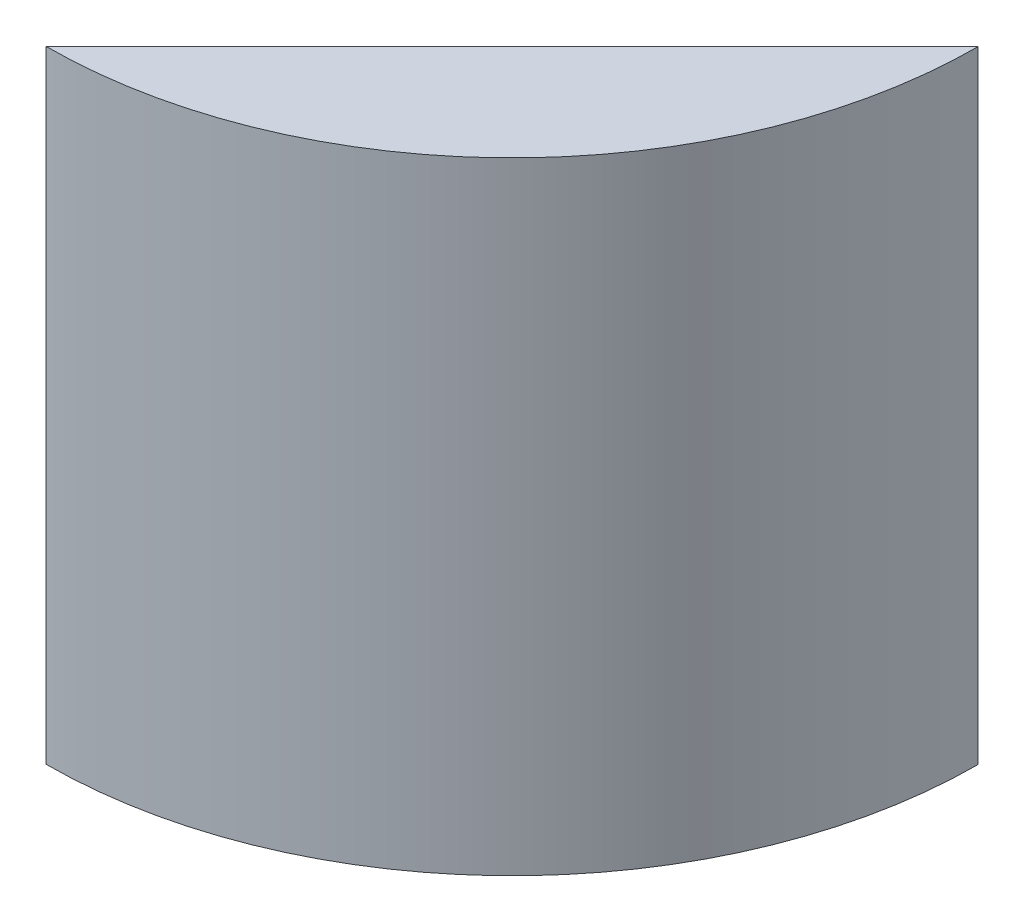
ISO-10303-21;
HEADER;
FILE_DESCRIPTION(('STEP AP214'),'2;1');
FILE_NAME('part.step','',(''),(''),'','','');
FILE_SCHEMA(('AUTOMOTIVE_DESIGN { 1 0 10303 214 1 1 1 1 }'));
ENDSEC;
DATA;
#1=APPLICATION_CONTEXT('core data for automotive mechanical design processes');
#2=APPLICATION_PROTOCOL_DEFINITION('international standard','automotive_design',2000,#1);
#3=PRODUCT_CONTEXT('',#1,'mechanical');
#4=PRODUCT('Part','Part','',(#3));
#5=PRODUCT_RELATED_PRODUCT_CATEGORY('part','',(#4));
#6=PRODUCT_DEFINITION_FORMATION('','',#4);
#7=PRODUCT_DEFINITION_CONTEXT('part definition',#1,'design');
#8=PRODUCT_DEFINITION('design','',#6,#7);
#9=PRODUCT_DEFINITION_SHAPE('','',#8);
#10=(LENGTH_UNIT() NAMED_UNIT(*) SI_UNIT(.MILLI.,.METRE.));
#11=(NAMED_UNIT(*) PLANE_ANGLE_UNIT() SI_UNIT($,.RADIAN.));
#12=(NAMED_UNIT(*) SI_UNIT($,.STERADIAN.) SOLID_ANGLE_UNIT());
#13=UNCERTAINTY_MEASURE_WITH_UNIT(LENGTH_MEASURE(1.E-05),#10,'distance_accuracy_value','');
#14=(GEOMETRIC_REPRESENTATION_CONTEXT(3) GLOBAL_UNCERTAINTY_ASSIGNED_CONTEXT((#13)) GLOBAL_UNIT_ASSIGNED_CONTEXT((#10,
#11,#12)) REPRESENTATION_CONTEXT('',''));
#15=CARTESIAN_POINT('',(0.,0.,0.));
#16=DIRECTION('',(0.,0.,1.));
#17=DIRECTION('',(1.,0.,0.));
#18=AXIS2_PLACEMENT_3D('',#15,#16,#17);
#19=CARTESIAN_POINT('',(0.,114.3,0.));
#20=DIRECTION('',(0.,-1.,0.));
#21=DIRECTION('',(0.,0.,-1.));
#22=AXIS2_PLACEMENT_3D('',#19,#20,#21);
#23=CYLINDRICAL_SURFACE('',#22,85.725);
#24=CARTESIAN_POINT('',(0.,0.,0.));
#25=DIRECTION('',(0.,1.,0.));
#26=DIRECTION('',(0.,0.,1.));
#27=AXIS2_PLACEMENT_3D('',#24,#25,#26);
#28=CIRCLE('',#27,85.725);
#29=CARTESIAN_POINT('',(0.,0.,85.725));
#30=VERTEX_POINT('',#29);
#31=CARTESIAN_POINT('',(85.7249336213076,0.,0.106680000000005));
#32=VERTEX_POINT('',#31);
#33=EDGE_CURVE('E71',#30,#32,#28,.T.);
#34=ORIENTED_EDGE('',*,*,#33,.T.);
#35=DIRECTION('',(0.,1.,0.));
#36=VECTOR('',#35,1.);
#37=CARTESIAN_POINT('',(85.7249336213076,-38.1,0.106680000000005));
#38=LINE('',#37,#36);
#39=CARTESIAN_POINT('',(85.7249336213076,114.3,0.106680000000005));
#40=VERTEX_POINT('',#39);
#41=EDGE_CURVE('E50',#32,#40,#38,.T.);
#42=ORIENTED_EDGE('',*,*,#41,.T.);
#43=CARTESIAN_POINT('',(0.,114.3,0.));
#44=DIRECTION('',(0.,1.,0.));
#45=DIRECTION('',(0.,0.,1.));
#46=AXIS2_PLACEMENT_3D('',#43,#44,#45);
#47=CIRCLE('',#46,85.725);
#48=CARTESIAN_POINT('',(0.,114.3,85.725));
#49=VERTEX_POINT('',#48);
#50=EDGE_CURVE('E43',#49,#40,#47,.T.);
#51=ORIENTED_EDGE('',*,*,#50,.F.);
#52=DIRECTION('',(0.,1.,0.));
#53=VECTOR('',#52,1.);
#54=CARTESIAN_POINT('',(0.,-38.1,85.725));
#55=LINE('',#54,#53);
#56=EDGE_CURVE('E57',#30,#49,#55,.T.);
#57=ORIENTED_EDGE('',*,*,#56,.F.);
#58=EDGE_LOOP('',(#34,#42,#51,#57));
#59=FACE_BOUND('',#58,.T.);
#60=ADVANCED_FACE('F36',(#59),#23,.T.);
#61=CARTESIAN_POINT('',(0.,114.3,0.));
#62=DIRECTION('',(0.,1.,0.));
#63=DIRECTION('',(0.,0.,1.));
#64=AXIS2_PLACEMENT_3D('',#61,#62,#63);
#65=PLANE('',#64);
#66=DIRECTION('',(0.707546621942485,0.,-0.706666666666667));
#67=VECTOR('',#66,1.);
#68=CARTESIAN_POINT('',(85.7249336213076,114.3,0.106680000000005));
#69=LINE('',#68,#67);
#70=EDGE_CURVE('E60',#49,#40,#69,.T.);
#71=ORIENTED_EDGE('',*,*,#70,.F.);
#72=ORIENTED_EDGE('',*,*,#50,.T.);
#73=EDGE_LOOP('',(#71,#72));
#74=FACE_BOUND('',#73,.T.);
#75=ADVANCED_FACE('F68',(#74),#65,.T.);
#76=CARTESIAN_POINT('',(0.,0.,0.));
#77=DIRECTION('',(0.,1.,0.));
#78=DIRECTION('',(0.,0.,1.));
#79=AXIS2_PLACEMENT_3D('',#76,#77,#78);
#80=PLANE('',#79);
#81=CARTESIAN_POINT('',(51.7207334053269,0.,51.7851370830098));
#82=DIRECTION('',(0.,-1.,0.));
#83=DIRECTION('',(0.,0.,-1.));
#84=AXIS2_PLACEMENT_3D('',#81,#82,#83);
#85=CIRCLE('',#84,6.985);
#86=CARTESIAN_POINT('',(51.7207334053269,0.,44.8001370830098));
#87=VERTEX_POINT('',#86);
#88=EDGE_CURVE('E111',#87,#87,#85,.T.);
#89=ORIENTED_EDGE('',*,*,#88,.F.);
#90=EDGE_LOOP('',(#89));
#91=FACE_BOUND('',#90,.T.);
#92=ORIENTED_EDGE('',*,*,#33,.F.);
#93=DIRECTION('',(0.707546621942485,0.,-0.706666666666667));
#94=VECTOR('',#93,1.);
#95=CARTESIAN_POINT('',(42.8624668106538,0.,42.91584));
#96=LINE('',#95,#94);
#97=EDGE_CURVE('E11',#30,#32,#96,.T.);
#98=ORIENTED_EDGE('',*,*,#97,.T.);
#99=EDGE_LOOP('',(#92,#98));
#100=FACE_BOUND('',#99,.T.);
#101=ADVANCED_FACE('F126',(#91,#100),#80,.F.);
#102=CARTESIAN_POINT('',(85.7249336213076,-38.1,0.106680000000005));
#103=DIRECTION('',(0.706666666666667,0.,0.707546621942485));
#104=DIRECTION('',(0.707546621942485,0.,-0.706666666666667));
#105=AXIS2_PLACEMENT_3D('',#102,#103,#104);
#106=PLANE('',#105);
#107=CARTESIAN_POINT('',(23.7843659629807,73.636006083369,61.9702139652701));
#108=DIRECTION('',(-0.706666666666667,0.,-0.707546621942485));
#109=DIRECTION('',(-0.707546621942485,0.,0.706666666666667));
#110=AXIS2_PLACEMENT_3D('',#107,#108,#109);
#111=CIRCLE('',#110,2.778125);
#112=CARTESIAN_POINT('',(21.8187130038967,73.636006083369,63.9334222986035));
#113=VERTEX_POINT('',#112);
#114=EDGE_CURVE('E81',#113,#113,#111,.T.);
#115=ORIENTED_EDGE('',*,*,#114,.F.);
#116=EDGE_LOOP('',(#115));
#117=FACE_BOUND('',#116,.T.);
#118=CARTESIAN_POINT('',(53.3759020660972,87.122,32.41548));
#119=DIRECTION('',(-0.706666666666667,0.,-0.707546621942485));
#120=DIRECTION('',(-0.707546621942485,0.,0.706666666666667));
#121=AXIS2_PLACEMENT_3D('',#118,#119,#120);
#122=CIRCLE('',#121,2.77812499999999);
#123=CARTESIAN_POINT('',(51.4102491070133,87.122,34.3786883333333));
#124=VERTEX_POINT('',#123);
#125=EDGE_CURVE('E96',#124,#124,#122,.T.);
#126=ORIENTED_EDGE('',*,*,#125,.F.);
#127=EDGE_LOOP('',(#126));
#128=FACE_BOUND('',#127,.T.);
#129=CARTESIAN_POINT('',(69.5504178437024,29.21,16.26108));
#130=DIRECTION('',(-0.706666666666667,0.,-0.707546621942485));
#131=DIRECTION('',(-0.707546621942485,0.,0.706666666666667));
#132=AXIS2_PLACEMENT_3D('',#129,#130,#131);
#133=CIRCLE('',#132,2.778125);
#134=CARTESIAN_POINT('',(67.5847648846185,29.21,18.2242883333333));
#135=VERTEX_POINT('',#134);
#136=EDGE_CURVE('E89',#135,#135,#133,.T.);
#137=ORIENTED_EDGE('',*,*,#136,.F.);
#138=EDGE_LOOP('',(#137));
#139=FACE_BOUND('',#138,.T.);
#140=CARTESIAN_POINT('',(53.3759020660972,29.21,32.41548));
#141=DIRECTION('',(-0.706666666666667,0.,-0.707546621942485));
#142=DIRECTION('',(-0.707546621942485,0.,0.706666666666667));
#143=AXIS2_PLACEMENT_3D('',#140,#141,#142);
#144=CIRCLE('',#143,2.778125);
#145=CARTESIAN_POINT('',(51.4102491070133,29.21,34.3786883333333));
#146=VERTEX_POINT('',#145);
#147=EDGE_CURVE('E106',#146,#146,#144,.T.);
#148=ORIENTED_EDGE('',*,*,#147,.F.);
#149=EDGE_LOOP('',(#148));
#150=FACE_BOUND('',#149,.T.);
#151=CARTESIAN_POINT('',(38.161713320852,73.636006083369,47.6107472986035));
#152=DIRECTION('',(-0.706666666666667,0.,-0.707546621942485));
#153=DIRECTION('',(-0.707546621942485,0.,0.706666666666667));
#154=AXIS2_PLACEMENT_3D('',#151,#152,#153);
#155=CIRCLE('',#154,2.778125);
#156=CARTESIAN_POINT('',(36.196060361768,73.636006083369,49.5739556319368));
#157=VERTEX_POINT('',#156);
#158=EDGE_CURVE('E88',#157,#157,#155,.T.);
#159=ORIENTED_EDGE('',*,*,#158,.F.);
#160=EDGE_LOOP('',(#159));
#161=FACE_BOUND('',#160,.T.);
#162=CARTESIAN_POINT('',(69.5504178437024,87.122,16.26108));
#163=DIRECTION('',(-0.706666666666667,0.,-0.707546621942485));
#164=DIRECTION('',(-0.707546621942485,0.,0.706666666666667));
#165=AXIS2_PLACEMENT_3D('',#162,#163,#164);
#166=CIRCLE('',#165,2.778125);
#167=CARTESIAN_POINT('',(67.5847648846185,87.122,18.2242883333333));
#168=VERTEX_POINT('',#167);
#169=EDGE_CURVE('E75',#168,#168,#166,.T.);
#170=ORIENTED_EDGE('',*,*,#169,.F.);
#171=EDGE_LOOP('',(#170));
#172=FACE_BOUND('',#171,.T.);
#173=ORIENTED_EDGE('',*,*,#56,.T.);
#174=ORIENTED_EDGE('',*,*,#70,.T.);
#175=ORIENTED_EDGE('',*,*,#41,.F.);
#176=ORIENTED_EDGE('',*,*,#97,.F.);
#177=EDGE_LOOP('',(#173,#174,#175,#176));
#178=FACE_BOUND('',#177,.T.);
#179=ADVANCED_FACE('F59',(#117,#128,#139,#150,#161,#172,#178),#106,.F.);
#180=CARTESIAN_POINT('',(78.5250845103691,87.122,25.2469220986696));
#181=DIRECTION('',(-0.706666666666667,0.,-0.707546621942485));
#182=DIRECTION('',(-0.707546621942485,0.,0.706666666666667));
#183=AXIS2_PLACEMENT_3D('',#180,#181,#182);
#184=CYLINDRICAL_SURFACE('',#183,2.778125);
#185=CARTESIAN_POINT('',(78.5250845103691,87.122,25.2469220986696));
#186=DIRECTION('',(-0.706666666666667,0.,-0.707546621942485));
#187=DIRECTION('',(-0.707546621942485,0.,0.706666666666667));
#188=AXIS2_PLACEMENT_3D('',#185,#186,#187);
#189=CIRCLE('',#188,2.778125);
#190=CARTESIAN_POINT('',(76.5594315512851,87.122,27.2101304320029));
#191=VERTEX_POINT('',#190);
#192=EDGE_CURVE('E69',#191,#191,#189,.T.);
#193=ORIENTED_EDGE('',*,*,#192,.F.);
#194=EDGE_LOOP('',(#193));
#195=FACE_BOUND('',#194,.T.);
#196=ORIENTED_EDGE('',*,*,#169,.T.);
#197=EDGE_LOOP('',(#196));
#198=FACE_BOUND('',#197,.T.);
#199=ADVANCED_FACE('F133',(#195,#198),#184,.F.);
#200=CARTESIAN_POINT('',(78.5250845103691,87.122,25.2469220986696));
#201=DIRECTION('',(-0.706666666666667,0.,-0.707546621942485));
#202=DIRECTION('',(-0.707546621942485,0.,0.706666666666667));
#203=AXIS2_PLACEMENT_3D('',#200,#201,#202);
#204=PLANE('',#203);
#205=ORIENTED_EDGE('',*,*,#192,.T.);
#206=EDGE_LOOP('',(#205));
#207=FACE_BOUND('',#206,.T.);
#208=ADVANCED_FACE('F160',(#207),#204,.T.);
#209=CARTESIAN_POINT('',(47.1363799875186,73.636006083369,56.596589397273));
#210=DIRECTION('',(-0.706666666666667,0.,-0.707546621942485));
#211=DIRECTION('',(-0.707546621942485,0.,0.706666666666667));
#212=AXIS2_PLACEMENT_3D('',#209,#210,#211);
#213=CYLINDRICAL_SURFACE('',#212,2.778125);
#214=CARTESIAN_POINT('',(47.1363799875186,73.636006083369,56.596589397273));
#215=DIRECTION('',(-0.706666666666667,0.,-0.707546621942485));
#216=DIRECTION('',(-0.707546621942485,0.,0.706666666666667));
#217=AXIS2_PLACEMENT_3D('',#214,#215,#216);
#218=CIRCLE('',#217,2.778125);
#219=CARTESIAN_POINT('',(45.1707270284347,73.636006083369,58.5597977306064));
#220=VERTEX_POINT('',#219);
#221=EDGE_CURVE('E103',#220,#220,#218,.T.);
#222=ORIENTED_EDGE('',*,*,#221,.F.);
#223=EDGE_LOOP('',(#222));
#224=FACE_BOUND('',#223,.T.);
#225=ORIENTED_EDGE('',*,*,#158,.T.);
#226=EDGE_LOOP('',(#225));
#227=FACE_BOUND('',#226,.T.);
#228=ADVANCED_FACE('F170',(#224,#227),#213,.F.);
#229=CARTESIAN_POINT('',(47.1363799875186,73.636006083369,56.596589397273));
#230=DIRECTION('',(-0.706666666666667,0.,-0.707546621942485));
#231=DIRECTION('',(-0.707546621942485,0.,0.706666666666667));
#232=AXIS2_PLACEMENT_3D('',#229,#230,#231);
#233=PLANE('',#232);
#234=ORIENTED_EDGE('',*,*,#221,.T.);
#235=EDGE_LOOP('',(#234));
#236=FACE_BOUND('',#235,.T.);
#237=ADVANCED_FACE('F180',(#236),#233,.T.);
#238=CARTESIAN_POINT('',(62.3505687327639,29.21,41.4013220986696));
#239=DIRECTION('',(-0.706666666666667,0.,-0.707546621942485));
#240=DIRECTION('',(-0.707546621942485,0.,0.706666666666667));
#241=AXIS2_PLACEMENT_3D('',#238,#239,#240);
#242=CYLINDRICAL_SURFACE('',#241,2.778125);
#243=CARTESIAN_POINT('',(62.3505687327639,29.21,41.4013220986696));
#244=DIRECTION('',(-0.706666666666667,0.,-0.707546621942485));
#245=DIRECTION('',(-0.707546621942485,0.,0.706666666666667));
#246=AXIS2_PLACEMENT_3D('',#243,#244,#245);
#247=CIRCLE('',#246,2.778125);
#248=CARTESIAN_POINT('',(60.3849157736799,29.21,43.3645304320029));
#249=VERTEX_POINT('',#248);
#250=EDGE_CURVE('E93',#249,#249,#247,.T.);
#251=ORIENTED_EDGE('',*,*,#250,.F.);
#252=EDGE_LOOP('',(#251));
#253=FACE_BOUND('',#252,.T.);
#254=ORIENTED_EDGE('',*,*,#147,.T.);
#255=EDGE_LOOP('',(#254));
#256=FACE_BOUND('',#255,.T.);
#257=ADVANCED_FACE('F190',(#253,#256),#242,.F.);
#258=CARTESIAN_POINT('',(62.3505687327639,29.21,41.4013220986696));
#259=DIRECTION('',(-0.706666666666667,0.,-0.707546621942485));
#260=DIRECTION('',(-0.707546621942485,0.,0.706666666666667));
#261=AXIS2_PLACEMENT_3D('',#258,#259,#260);
#262=PLANE('',#261);
#263=ORIENTED_EDGE('',*,*,#250,.T.);
#264=EDGE_LOOP('',(#263));
#265=FACE_BOUND('',#264,.T.);
#266=ADVANCED_FACE('F200',(#265),#262,.T.);
#267=CARTESIAN_POINT('',(78.5250845103691,29.21,25.2469220986696));
#268=DIRECTION('',(-0.706666666666667,0.,-0.707546621942485));
#269=DIRECTION('',(-0.707546621942485,0.,0.706666666666667));
#270=AXIS2_PLACEMENT_3D('',#267,#268,#269);
#271=CYLINDRICAL_SURFACE('',#270,2.778125);
#272=CARTESIAN_POINT('',(78.5250845103691,29.21,25.2469220986696));
#273=DIRECTION('',(-0.706666666666667,0.,-0.707546621942485));
#274=DIRECTION('',(-0.707546621942485,0.,0.706666666666667));
#275=AXIS2_PLACEMENT_3D('',#272,#273,#274);
#276=CIRCLE('',#275,2.778125);
#277=CARTESIAN_POINT('',(76.5594315512851,29.21,27.2101304320029));
#278=VERTEX_POINT('',#277);
#279=EDGE_CURVE('E92',#278,#278,#276,.T.);
#280=ORIENTED_EDGE('',*,*,#279,.F.);
#281=EDGE_LOOP('',(#280));
#282=FACE_BOUND('',#281,.T.);
#283=ORIENTED_EDGE('',*,*,#136,.T.);
#284=EDGE_LOOP('',(#283));
#285=FACE_BOUND('',#284,.T.);
#286=ADVANCED_FACE('F210',(#282,#285),#271,.F.);
#287=CARTESIAN_POINT('',(78.5250845103691,29.21,25.2469220986696));
#288=DIRECTION('',(-0.706666666666667,0.,-0.707546621942485));
#289=DIRECTION('',(-0.707546621942485,0.,0.706666666666667));
#290=AXIS2_PLACEMENT_3D('',#287,#288,#289);
#291=PLANE('',#290);
#292=ORIENTED_EDGE('',*,*,#279,.T.);
#293=EDGE_LOOP('',(#292));
#294=FACE_BOUND('',#293,.T.);
#295=ADVANCED_FACE('F220',(#294),#291,.T.);
#296=CARTESIAN_POINT('',(62.3505687327639,87.122,41.4013220986696));
#297=DIRECTION('',(-0.706666666666667,0.,-0.707546621942485));
#298=DIRECTION('',(-0.707546621942485,0.,0.706666666666667));
#299=AXIS2_PLACEMENT_3D('',#296,#297,#298);
#300=CYLINDRICAL_SURFACE('',#299,2.77812499999999);
#301=CARTESIAN_POINT('',(62.3505687327639,87.122,41.4013220986696));
#302=DIRECTION('',(-0.706666666666667,0.,-0.707546621942485));
#303=DIRECTION('',(-0.707546621942485,0.,0.706666666666667));
#304=AXIS2_PLACEMENT_3D('',#301,#302,#303);
#305=CIRCLE('',#304,2.77812499999999);
#306=CARTESIAN_POINT('',(60.3849157736799,87.122,43.3645304320029));
#307=VERTEX_POINT('',#306);
#308=EDGE_CURVE('E78',#307,#307,#305,.T.);
#309=ORIENTED_EDGE('',*,*,#308,.F.);
#310=EDGE_LOOP('',(#309));
#311=FACE_BOUND('',#310,.T.);
#312=ORIENTED_EDGE('',*,*,#125,.T.);
#313=EDGE_LOOP('',(#312));
#314=FACE_BOUND('',#313,.T.);
#315=ADVANCED_FACE('F230',(#311,#314),#300,.F.);
#316=CARTESIAN_POINT('',(62.3505687327639,87.122,41.4013220986696));
#317=DIRECTION('',(-0.706666666666667,0.,-0.707546621942485));
#318=DIRECTION('',(-0.707546621942485,0.,0.706666666666667));
#319=AXIS2_PLACEMENT_3D('',#316,#317,#318);
#320=PLANE('',#319);
#321=ORIENTED_EDGE('',*,*,#308,.T.);
#322=EDGE_LOOP('',(#321));
#323=FACE_BOUND('',#322,.T.);
#324=ADVANCED_FACE('F240',(#323),#320,.T.);
#325=CARTESIAN_POINT('',(32.7590326296473,73.636006083369,70.9560560639397));
#326=DIRECTION('',(-0.706666666666667,0.,-0.707546621942485));
#327=DIRECTION('',(-0.707546621942485,0.,0.706666666666667));
#328=AXIS2_PLACEMENT_3D('',#325,#326,#327);
#329=CYLINDRICAL_SURFACE('',#328,2.778125);
#330=CARTESIAN_POINT('',(32.7590326296473,73.636006083369,70.9560560639397));
#331=DIRECTION('',(-0.706666666666667,0.,-0.707546621942485));
#332=DIRECTION('',(-0.707546621942485,0.,0.706666666666667));
#333=AXIS2_PLACEMENT_3D('',#330,#331,#332);
#334=CIRCLE('',#333,2.778125);
#335=CARTESIAN_POINT('',(30.7933796705634,73.636006083369,72.919264397273));
#336=VERTEX_POINT('',#335);
#337=EDGE_CURVE('E84',#336,#336,#334,.T.);
#338=ORIENTED_EDGE('',*,*,#337,.F.);
#339=EDGE_LOOP('',(#338));
#340=FACE_BOUND('',#339,.T.);
#341=ORIENTED_EDGE('',*,*,#114,.T.);
#342=EDGE_LOOP('',(#341));
#343=FACE_BOUND('',#342,.T.);
#344=ADVANCED_FACE('F250',(#340,#343),#329,.F.);
#345=CARTESIAN_POINT('',(32.7590326296473,73.636006083369,70.9560560639397));
#346=DIRECTION('',(-0.706666666666667,0.,-0.707546621942485));
#347=DIRECTION('',(-0.707546621942485,0.,0.706666666666667));
#348=AXIS2_PLACEMENT_3D('',#345,#346,#347);
#349=PLANE('',#348);
#350=ORIENTED_EDGE('',*,*,#337,.T.);
#351=EDGE_LOOP('',(#350));
#352=FACE_BOUND('',#351,.T.);
#353=ADVANCED_FACE('F122',(#352),#349,.T.);
#354=CARTESIAN_POINT('',(51.7207334053269,6.096,51.7851370830098));
#355=DIRECTION('',(0.,-1.,0.));
#356=DIRECTION('',(0.,0.,-1.));
#357=AXIS2_PLACEMENT_3D('',#354,#355,#356);
#358=CYLINDRICAL_SURFACE('',#357,6.985);
#359=CARTESIAN_POINT('',(51.7207334053269,6.096,51.7851370830098));
#360=DIRECTION('',(0.,-1.,0.));
#361=DIRECTION('',(0.,0.,-1.));
#362=AXIS2_PLACEMENT_3D('',#359,#360,#361);
#363=CIRCLE('',#362,6.985);
#364=CARTESIAN_POINT('',(51.7207334053269,6.096,44.8001370830098));
#365=VERTEX_POINT('',#364);
#366=EDGE_CURVE('E85',#365,#365,#363,.T.);
#367=ORIENTED_EDGE('',*,*,#366,.F.);
#368=EDGE_LOOP('',(#367));
#369=FACE_BOUND('',#368,.T.);
#370=ORIENTED_EDGE('',*,*,#88,.T.);
#371=EDGE_LOOP('',(#370));
#372=FACE_BOUND('',#371,.T.);
#373=ADVANCED_FACE('F119',(#369,#372),#358,.F.);
#374=CARTESIAN_POINT('',(51.7207334053269,6.096,51.7851370830098));
#375=DIRECTION('',(0.,-1.,0.));
#376=DIRECTION('',(0.,0.,-1.));
#377=AXIS2_PLACEMENT_3D('',#374,#375,#376);
#378=PLANE('',#377);
#379=ORIENTED_EDGE('',*,*,#366,.T.);
#380=EDGE_LOOP('',(#379));
#381=FACE_BOUND('',#380,.T.);
#382=ADVANCED_FACE('F117',(#381),#378,.T.);
#383=CLOSED_SHELL('',(#60,#75,#101,#179,#199,#208,#228,#237,#257,#266,#286,#295,#315,#324,#344,
#353,#373,#382));
#384=MANIFOLD_SOLID_BREP('B2',#383);
#385=ADVANCED_BREP_SHAPE_REPRESENTATION('',(#18,#384),#14);
#386=SHAPE_DEFINITION_REPRESENTATION(#9,#385);
ENDSEC;
END-ISO-10303-21;
